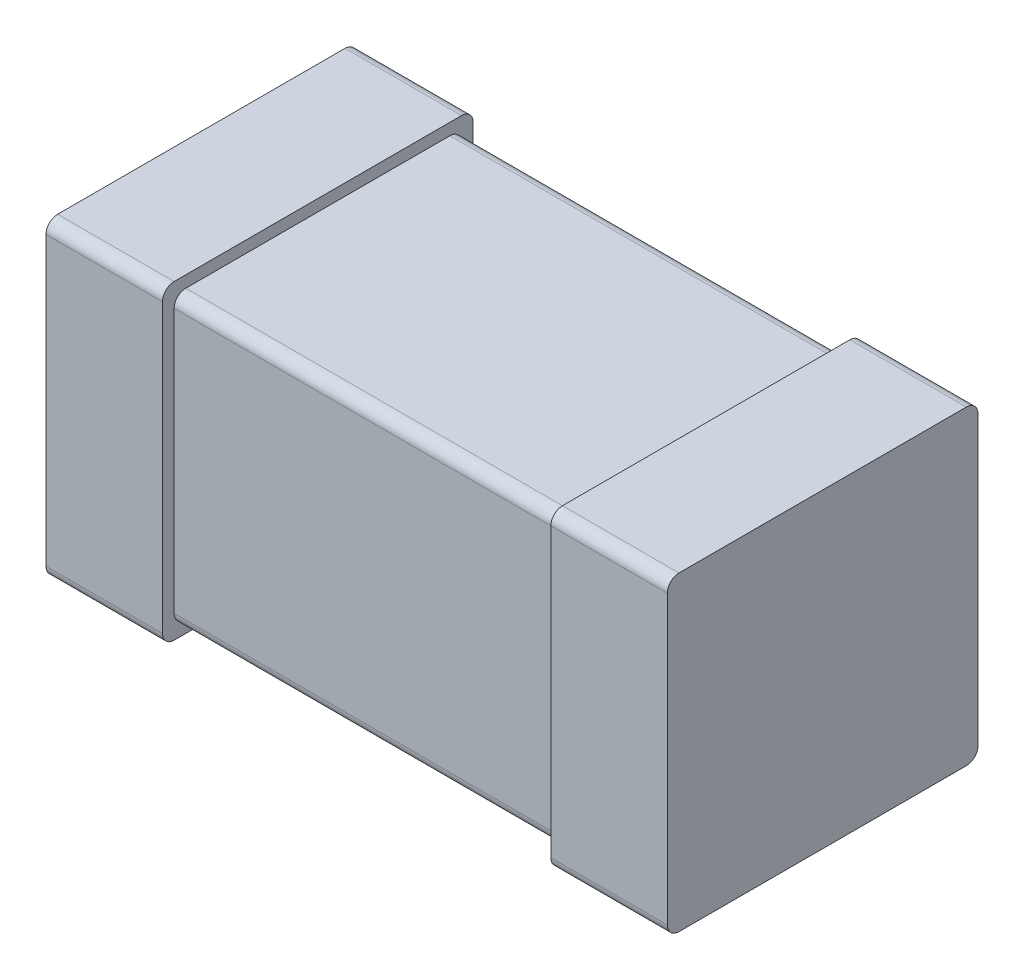
ISO-10303-21;
HEADER;
FILE_DESCRIPTION(('STEP AP214'),'2;1');
FILE_NAME('part.step','',(''),(''),'','','');
FILE_SCHEMA(('AUTOMOTIVE_DESIGN { 1 0 10303 214 1 1 1 1 }'));
ENDSEC;
DATA;
#1=APPLICATION_CONTEXT('core data for automotive mechanical design processes');
#2=APPLICATION_PROTOCOL_DEFINITION('international standard','automotive_design',2000,#1);
#3=PRODUCT_CONTEXT('',#1,'mechanical');
#4=PRODUCT('Part','Part','',(#3));
#5=PRODUCT_RELATED_PRODUCT_CATEGORY('part','',(#4));
#6=PRODUCT_DEFINITION_FORMATION('','',#4);
#7=PRODUCT_DEFINITION_CONTEXT('part definition',#1,'design');
#8=PRODUCT_DEFINITION('design','',#6,#7);
#9=PRODUCT_DEFINITION_SHAPE('','',#8);
#10=(LENGTH_UNIT() NAMED_UNIT(*) SI_UNIT(.MILLI.,.METRE.));
#11=(NAMED_UNIT(*) PLANE_ANGLE_UNIT() SI_UNIT($,.RADIAN.));
#12=(NAMED_UNIT(*) SI_UNIT($,.STERADIAN.) SOLID_ANGLE_UNIT());
#13=UNCERTAINTY_MEASURE_WITH_UNIT(LENGTH_MEASURE(1.E-05),#10,'distance_accuracy_value','');
#14=(GEOMETRIC_REPRESENTATION_CONTEXT(3) GLOBAL_UNCERTAINTY_ASSIGNED_CONTEXT((#13)) GLOBAL_UNIT_ASSIGNED_CONTEXT((#10,
#11,#12)) REPRESENTATION_CONTEXT('',''));
#15=CARTESIAN_POINT('',(0.,0.,0.));
#16=DIRECTION('',(0.,0.,1.));
#17=DIRECTION('',(1.,0.,0.));
#18=AXIS2_PLACEMENT_3D('',#15,#16,#17);
#19=CARTESIAN_POINT('',(0.8,-0.4,0.));
#20=DIRECTION('',(1.,0.,0.));
#21=DIRECTION('',(0.,1.,0.));
#22=AXIS2_PLACEMENT_3D('',#19,#20,#21);
#23=PLANE('',#22);
#24=DIRECTION('',(0.,0.,1.));
#25=VECTOR('',#24,1.);
#26=CARTESIAN_POINT('',(0.8,-0.4,0.));
#27=LINE('',#26,#25);
#28=CARTESIAN_POINT('',(0.8,-0.4,0.03));
#29=VERTEX_POINT('',#28);
#30=CARTESIAN_POINT('',(0.8,-0.4,0.77));
#31=VERTEX_POINT('',#30);
#32=EDGE_CURVE('E241',#29,#31,#27,.T.);
#33=ORIENTED_EDGE('',*,*,#32,.F.);
#34=CARTESIAN_POINT('',(0.8,-0.37,0.03));
#35=DIRECTION('',(1.,0.,0.));
#36=DIRECTION('',(0.,0.,1.));
#37=AXIS2_PLACEMENT_3D('',#34,#35,#36);
#38=CIRCLE('',#37,0.03);
#39=CARTESIAN_POINT('',(0.8,-0.37,0.));
#40=VERTEX_POINT('',#39);
#41=EDGE_CURVE('E304',#29,#40,#38,.T.);
#42=ORIENTED_EDGE('',*,*,#41,.T.);
#43=DIRECTION('',(0.,1.,0.));
#44=VECTOR('',#43,1.);
#45=CARTESIAN_POINT('',(0.8,-0.4,0.));
#46=LINE('',#45,#44);
#47=CARTESIAN_POINT('',(0.8,0.37,0.));
#48=VERTEX_POINT('',#47);
#49=EDGE_CURVE('E316',#40,#48,#46,.T.);
#50=ORIENTED_EDGE('',*,*,#49,.T.);
#51=CARTESIAN_POINT('',(0.8,0.37,0.03));
#52=DIRECTION('',(-1.,0.,0.));
#53=DIRECTION('',(0.,0.,1.));
#54=AXIS2_PLACEMENT_3D('',#51,#52,#53);
#55=CIRCLE('',#54,0.03);
#56=CARTESIAN_POINT('',(0.8,0.4,0.03));
#57=VERTEX_POINT('',#56);
#58=EDGE_CURVE('E227',#57,#48,#55,.T.);
#59=ORIENTED_EDGE('',*,*,#58,.F.);
#60=DIRECTION('',(0.,0.,1.));
#61=VECTOR('',#60,1.);
#62=CARTESIAN_POINT('',(0.8,0.4,0.));
#63=LINE('',#62,#61);
#64=CARTESIAN_POINT('',(0.8,0.4,0.77));
#65=VERTEX_POINT('',#64);
#66=EDGE_CURVE('E11',#57,#65,#63,.T.);
#67=ORIENTED_EDGE('',*,*,#66,.T.);
#68=CARTESIAN_POINT('',(0.8,0.37,0.77));
#69=DIRECTION('',(1.,0.,0.));
#70=DIRECTION('',(0.,0.,1.));
#71=AXIS2_PLACEMENT_3D('',#68,#69,#70);
#72=CIRCLE('',#71,0.03);
#73=CARTESIAN_POINT('',(0.8,0.37,0.8));
#74=VERTEX_POINT('',#73);
#75=EDGE_CURVE('E225',#65,#74,#72,.T.);
#76=ORIENTED_EDGE('',*,*,#75,.T.);
#77=DIRECTION('',(0.,1.,0.));
#78=VECTOR('',#77,1.);
#79=CARTESIAN_POINT('',(0.8,-0.4,0.8));
#80=LINE('',#79,#78);
#81=CARTESIAN_POINT('',(0.8,-0.37,0.8));
#82=VERTEX_POINT('',#81);
#83=EDGE_CURVE('E319',#82,#74,#80,.T.);
#84=ORIENTED_EDGE('',*,*,#83,.F.);
#85=CARTESIAN_POINT('',(0.8,-0.37,0.77));
#86=DIRECTION('',(-1.,0.,0.));
#87=DIRECTION('',(0.,0.,1.));
#88=AXIS2_PLACEMENT_3D('',#85,#86,#87);
#89=CIRCLE('',#88,0.03);
#90=EDGE_CURVE('E375',#31,#82,#89,.T.);
#91=ORIENTED_EDGE('',*,*,#90,.F.);
#92=EDGE_LOOP('',(#33,#42,#50,#59,#67,#76,#84,#91));
#93=FACE_BOUND('',#92,.T.);
#94=ADVANCED_FACE('F17',(#93),#23,.T.);
#95=CARTESIAN_POINT('',(0.5,0.4,0.));
#96=DIRECTION('',(0.,1.,0.));
#97=DIRECTION('',(1.,0.,0.));
#98=AXIS2_PLACEMENT_3D('',#95,#96,#97);
#99=PLANE('',#98);
#100=ORIENTED_EDGE('',*,*,#66,.F.);
#101=DIRECTION('',(1.,0.,0.));
#102=VECTOR('',#101,1.);
#103=CARTESIAN_POINT('',(0.5,0.4,0.03));
#104=LINE('',#103,#102);
#105=CARTESIAN_POINT('',(0.5,0.4,0.03));
#106=VERTEX_POINT('',#105);
#107=EDGE_CURVE('E247',#106,#57,#104,.T.);
#108=ORIENTED_EDGE('',*,*,#107,.F.);
#109=DIRECTION('',(0.,0.,1.));
#110=VECTOR('',#109,1.);
#111=CARTESIAN_POINT('',(0.5,0.4,0.));
#112=LINE('',#111,#110);
#113=CARTESIAN_POINT('',(0.5,0.4,0.77));
#114=VERTEX_POINT('',#113);
#115=EDGE_CURVE('E408',#106,#114,#112,.T.);
#116=ORIENTED_EDGE('',*,*,#115,.T.);
#117=DIRECTION('',(1.,0.,0.));
#118=VECTOR('',#117,1.);
#119=CARTESIAN_POINT('',(0.5,0.4,0.77));
#120=LINE('',#119,#118);
#121=EDGE_CURVE('E28',#114,#65,#120,.T.);
#122=ORIENTED_EDGE('',*,*,#121,.T.);
#123=EDGE_LOOP('',(#100,#108,#116,#122));
#124=FACE_BOUND('',#123,.T.);
#125=ADVANCED_FACE('F572',(#124),#99,.T.);
#126=CARTESIAN_POINT('',(0.5,0.37,0.77));
#127=DIRECTION('',(1.,0.,0.));
#128=DIRECTION('',(0.,1.,0.));
#129=AXIS2_PLACEMENT_3D('',#126,#127,#128);
#130=CYLINDRICAL_SURFACE('',#129,0.03);
#131=CARTESIAN_POINT('',(0.5,0.37,0.77));
#132=DIRECTION('',(1.,0.,0.));
#133=DIRECTION('',(0.,0.,1.));
#134=AXIS2_PLACEMENT_3D('',#131,#132,#133);
#135=CIRCLE('',#134,0.03);
#136=CARTESIAN_POINT('',(0.5,0.37,0.8));
#137=VERTEX_POINT('',#136);
#138=EDGE_CURVE('E335',#114,#137,#135,.T.);
#139=ORIENTED_EDGE('',*,*,#138,.T.);
#140=DIRECTION('',(1.,0.,0.));
#141=VECTOR('',#140,1.);
#142=CARTESIAN_POINT('',(0.5,0.37,0.8));
#143=LINE('',#142,#141);
#144=EDGE_CURVE('E251',#137,#74,#143,.T.);
#145=ORIENTED_EDGE('',*,*,#144,.T.);
#146=ORIENTED_EDGE('',*,*,#75,.F.);
#147=ORIENTED_EDGE('',*,*,#121,.F.);
#148=EDGE_LOOP('',(#139,#145,#146,#147));
#149=FACE_BOUND('',#148,.T.);
#150=ADVANCED_FACE('F498',(#149),#130,.T.);
#151=CARTESIAN_POINT('',(0.5,0.37,0.03));
#152=DIRECTION('',(1.,0.,0.));
#153=DIRECTION('',(0.,1.,0.));
#154=AXIS2_PLACEMENT_3D('',#151,#152,#153);
#155=CYLINDRICAL_SURFACE('',#154,0.03);
#156=ORIENTED_EDGE('',*,*,#107,.T.);
#157=ORIENTED_EDGE('',*,*,#58,.T.);
#158=DIRECTION('',(1.,0.,0.));
#159=VECTOR('',#158,1.);
#160=CARTESIAN_POINT('',(0.5,0.37,0.));
#161=LINE('',#160,#159);
#162=CARTESIAN_POINT('',(0.5,0.37,0.));
#163=VERTEX_POINT('',#162);
#164=EDGE_CURVE('E320',#163,#48,#161,.T.);
#165=ORIENTED_EDGE('',*,*,#164,.F.);
#166=CARTESIAN_POINT('',(0.5,0.37,0.03));
#167=DIRECTION('',(-1.,0.,0.));
#168=DIRECTION('',(0.,0.,1.));
#169=AXIS2_PLACEMENT_3D('',#166,#167,#168);
#170=CIRCLE('',#169,0.03);
#171=EDGE_CURVE('E21',#106,#163,#170,.T.);
#172=ORIENTED_EDGE('',*,*,#171,.F.);
#173=EDGE_LOOP('',(#156,#157,#165,#172));
#174=FACE_BOUND('',#173,.T.);
#175=ADVANCED_FACE('F619',(#174),#155,.T.);
#176=CARTESIAN_POINT('',(0.5,-0.4,0.8));
#177=DIRECTION('',(0.,0.,1.));
#178=DIRECTION('',(1.,0.,0.));
#179=AXIS2_PLACEMENT_3D('',#176,#177,#178);
#180=PLANE('',#179);
#181=DIRECTION('',(0.,1.,0.));
#182=VECTOR('',#181,1.);
#183=CARTESIAN_POINT('',(0.5,-0.4,0.8));
#184=LINE('',#183,#182);
#185=CARTESIAN_POINT('',(0.5,-0.37,0.8));
#186=VERTEX_POINT('',#185);
#187=EDGE_CURVE('E331',#186,#137,#184,.T.);
#188=ORIENTED_EDGE('',*,*,#187,.F.);
#189=DIRECTION('',(1.,0.,0.));
#190=VECTOR('',#189,1.);
#191=CARTESIAN_POINT('',(0.5,-0.37,0.8));
#192=LINE('',#191,#190);
#193=EDGE_CURVE('E392',#186,#82,#192,.T.);
#194=ORIENTED_EDGE('',*,*,#193,.T.);
#195=ORIENTED_EDGE('',*,*,#83,.T.);
#196=ORIENTED_EDGE('',*,*,#144,.F.);
#197=EDGE_LOOP('',(#188,#194,#195,#196));
#198=FACE_BOUND('',#197,.T.);
#199=ADVANCED_FACE('F493',(#198),#180,.T.);
#200=CARTESIAN_POINT('',(0.5,-0.4,0.));
#201=DIRECTION('',(0.,0.,1.));
#202=DIRECTION('',(1.,0.,0.));
#203=AXIS2_PLACEMENT_3D('',#200,#201,#202);
#204=PLANE('',#203);
#205=ORIENTED_EDGE('',*,*,#164,.T.);
#206=ORIENTED_EDGE('',*,*,#49,.F.);
#207=DIRECTION('',(1.,0.,0.));
#208=VECTOR('',#207,1.);
#209=CARTESIAN_POINT('',(0.5,-0.37,0.));
#210=LINE('',#209,#208);
#211=CARTESIAN_POINT('',(0.5,-0.37,0.));
#212=VERTEX_POINT('',#211);
#213=EDGE_CURVE('E245',#212,#40,#210,.T.);
#214=ORIENTED_EDGE('',*,*,#213,.F.);
#215=DIRECTION('',(0.,1.,0.));
#216=VECTOR('',#215,1.);
#217=CARTESIAN_POINT('',(0.5,-0.4,0.));
#218=LINE('',#217,#216);
#219=EDGE_CURVE('E240',#212,#163,#218,.T.);
#220=ORIENTED_EDGE('',*,*,#219,.T.);
#221=EDGE_LOOP('',(#205,#206,#214,#220));
#222=FACE_BOUND('',#221,.T.);
#223=ADVANCED_FACE('F608',(#222),#204,.F.);
#224=CARTESIAN_POINT('',(0.5,-0.37,0.77));
#225=DIRECTION('',(1.,0.,0.));
#226=DIRECTION('',(0.,-1.,0.));
#227=AXIS2_PLACEMENT_3D('',#224,#225,#226);
#228=CYLINDRICAL_SURFACE('',#227,0.03);
#229=DIRECTION('',(1.,0.,0.));
#230=VECTOR('',#229,1.);
#231=CARTESIAN_POINT('',(0.5,-0.4,0.77));
#232=LINE('',#231,#230);
#233=CARTESIAN_POINT('',(0.5,-0.4,0.77));
#234=VERTEX_POINT('',#233);
#235=EDGE_CURVE('E297',#234,#31,#232,.T.);
#236=ORIENTED_EDGE('',*,*,#235,.T.);
#237=ORIENTED_EDGE('',*,*,#90,.T.);
#238=ORIENTED_EDGE('',*,*,#193,.F.);
#239=CARTESIAN_POINT('',(0.5,-0.37,0.77));
#240=DIRECTION('',(-1.,0.,0.));
#241=DIRECTION('',(0.,0.,1.));
#242=AXIS2_PLACEMENT_3D('',#239,#240,#241);
#243=CIRCLE('',#242,0.03);
#244=EDGE_CURVE('E336',#234,#186,#243,.T.);
#245=ORIENTED_EDGE('',*,*,#244,.F.);
#246=EDGE_LOOP('',(#236,#237,#238,#245));
#247=FACE_BOUND('',#246,.T.);
#248=ADVANCED_FACE('F431',(#247),#228,.T.);
#249=CARTESIAN_POINT('',(0.5,-0.37,0.03));
#250=DIRECTION('',(1.,0.,0.));
#251=DIRECTION('',(0.,-1.,0.));
#252=AXIS2_PLACEMENT_3D('',#249,#250,#251);
#253=CYLINDRICAL_SURFACE('',#252,0.03);
#254=CARTESIAN_POINT('',(0.5,-0.37,0.03));
#255=DIRECTION('',(1.,0.,0.));
#256=DIRECTION('',(0.,0.,1.));
#257=AXIS2_PLACEMENT_3D('',#254,#255,#256);
#258=CIRCLE('',#257,0.03);
#259=CARTESIAN_POINT('',(0.5,-0.4,0.03));
#260=VERTEX_POINT('',#259);
#261=EDGE_CURVE('E235',#260,#212,#258,.T.);
#262=ORIENTED_EDGE('',*,*,#261,.T.);
#263=ORIENTED_EDGE('',*,*,#213,.T.);
#264=ORIENTED_EDGE('',*,*,#41,.F.);
#265=DIRECTION('',(1.,0.,0.));
#266=VECTOR('',#265,1.);
#267=CARTESIAN_POINT('',(0.5,-0.4,0.03));
#268=LINE('',#267,#266);
#269=EDGE_CURVE('E246',#260,#29,#268,.T.);
#270=ORIENTED_EDGE('',*,*,#269,.F.);
#271=EDGE_LOOP('',(#262,#263,#264,#270));
#272=FACE_BOUND('',#271,.T.);
#273=ADVANCED_FACE('F442',(#272),#253,.T.);
#274=CARTESIAN_POINT('',(0.5,-0.4,0.));
#275=DIRECTION('',(0.,1.,0.));
#276=DIRECTION('',(1.,0.,0.));
#277=AXIS2_PLACEMENT_3D('',#274,#275,#276);
#278=PLANE('',#277);
#279=ORIENTED_EDGE('',*,*,#235,.F.);
#280=DIRECTION('',(0.,0.,1.));
#281=VECTOR('',#280,1.);
#282=CARTESIAN_POINT('',(0.5,-0.4,0.));
#283=LINE('',#282,#281);
#284=EDGE_CURVE('E239',#260,#234,#283,.T.);
#285=ORIENTED_EDGE('',*,*,#284,.F.);
#286=ORIENTED_EDGE('',*,*,#269,.T.);
#287=ORIENTED_EDGE('',*,*,#32,.T.);
#288=EDGE_LOOP('',(#279,#285,#286,#287));
#289=FACE_BOUND('',#288,.T.);
#290=ADVANCED_FACE('F434',(#289),#278,.F.);
#291=CARTESIAN_POINT('',(0.5,-0.4,0.));
#292=DIRECTION('',(1.,0.,0.));
#293=DIRECTION('',(0.,1.,0.));
#294=AXIS2_PLACEMENT_3D('',#291,#292,#293);
#295=PLANE('',#294);
#296=DIRECTION('',(0.,1.,0.));
#297=VECTOR('',#296,1.);
#298=CARTESIAN_POINT('',(0.5,-0.37,0.03));
#299=LINE('',#298,#297);
#300=CARTESIAN_POINT('',(0.5,-0.34,0.03));
#301=VERTEX_POINT('',#300);
#302=CARTESIAN_POINT('',(0.5,0.34,0.03));
#303=VERTEX_POINT('',#302);
#304=EDGE_CURVE('E234',#301,#303,#299,.T.);
#305=ORIENTED_EDGE('',*,*,#304,.T.);
#306=CARTESIAN_POINT('',(0.5,0.34,0.06));
#307=DIRECTION('',(-1.,0.,0.));
#308=DIRECTION('',(0.,0.,1.));
#309=AXIS2_PLACEMENT_3D('',#306,#307,#308);
#310=CIRCLE('',#309,0.03);
#311=CARTESIAN_POINT('',(0.5,0.37,0.06));
#312=VERTEX_POINT('',#311);
#313=EDGE_CURVE('E233',#312,#303,#310,.T.);
#314=ORIENTED_EDGE('',*,*,#313,.F.);
#315=DIRECTION('',(0.,0.,1.));
#316=VECTOR('',#315,1.);
#317=CARTESIAN_POINT('',(0.5,0.37,0.03));
#318=LINE('',#317,#316);
#319=CARTESIAN_POINT('',(0.5,0.37,0.74));
#320=VERTEX_POINT('',#319);
#321=EDGE_CURVE('E252',#312,#320,#318,.T.);
#322=ORIENTED_EDGE('',*,*,#321,.T.);
#323=CARTESIAN_POINT('',(0.5,0.34,0.74));
#324=DIRECTION('',(1.,0.,0.));
#325=DIRECTION('',(0.,0.,1.));
#326=AXIS2_PLACEMENT_3D('',#323,#324,#325);
#327=CIRCLE('',#326,0.03);
#328=CARTESIAN_POINT('',(0.5,0.34,0.77));
#329=VERTEX_POINT('',#328);
#330=EDGE_CURVE('E221',#320,#329,#327,.T.);
#331=ORIENTED_EDGE('',*,*,#330,.T.);
#332=DIRECTION('',(0.,1.,0.));
#333=VECTOR('',#332,1.);
#334=CARTESIAN_POINT('',(0.5,-0.37,0.77));
#335=LINE('',#334,#333);
#336=CARTESIAN_POINT('',(0.5,-0.34,0.77));
#337=VERTEX_POINT('',#336);
#338=EDGE_CURVE('E345',#337,#329,#335,.T.);
#339=ORIENTED_EDGE('',*,*,#338,.F.);
#340=CARTESIAN_POINT('',(0.5,-0.34,0.74));
#341=DIRECTION('',(-1.,0.,0.));
#342=DIRECTION('',(0.,0.,1.));
#343=AXIS2_PLACEMENT_3D('',#340,#341,#342);
#344=CIRCLE('',#343,0.03);
#345=CARTESIAN_POINT('',(0.5,-0.37,0.74));
#346=VERTEX_POINT('',#345);
#347=EDGE_CURVE('E346',#346,#337,#344,.T.);
#348=ORIENTED_EDGE('',*,*,#347,.F.);
#349=DIRECTION('',(0.,0.,1.));
#350=VECTOR('',#349,1.);
#351=CARTESIAN_POINT('',(0.5,-0.37,0.03));
#352=LINE('',#351,#350);
#353=CARTESIAN_POINT('',(0.5,-0.37,0.06));
#354=VERTEX_POINT('',#353);
#355=EDGE_CURVE('E349',#354,#346,#352,.T.);
#356=ORIENTED_EDGE('',*,*,#355,.F.);
#357=CARTESIAN_POINT('',(0.5,-0.34,0.06));
#358=DIRECTION('',(1.,0.,0.));
#359=DIRECTION('',(0.,0.,1.));
#360=AXIS2_PLACEMENT_3D('',#357,#358,#359);
#361=CIRCLE('',#360,0.03);
#362=EDGE_CURVE('E260',#354,#301,#361,.T.);
#363=ORIENTED_EDGE('',*,*,#362,.T.);
#364=EDGE_LOOP('',(#305,#314,#322,#331,#339,#348,#356,#363));
#365=FACE_BOUND('',#364,.T.);
#366=ORIENTED_EDGE('',*,*,#244,.T.);
#367=ORIENTED_EDGE('',*,*,#187,.T.);
#368=ORIENTED_EDGE('',*,*,#138,.F.);
#369=ORIENTED_EDGE('',*,*,#115,.F.);
#370=ORIENTED_EDGE('',*,*,#171,.T.);
#371=ORIENTED_EDGE('',*,*,#219,.F.);
#372=ORIENTED_EDGE('',*,*,#261,.F.);
#373=ORIENTED_EDGE('',*,*,#284,.T.);
#374=EDGE_LOOP('',(#366,#367,#368,#369,#370,#371,#372,#373));
#375=FACE_BOUND('',#374,.T.);
#376=ADVANCED_FACE('F438',(#365,#375),#295,.F.);
#377=CARTESIAN_POINT('',(-0.5,-0.37,0.03));
#378=DIRECTION('',(0.,1.,0.));
#379=DIRECTION('',(1.,0.,0.));
#380=AXIS2_PLACEMENT_3D('',#377,#378,#379);
#381=PLANE('',#380);
#382=DIRECTION('',(1.,0.,0.));
#383=VECTOR('',#382,1.);
#384=CARTESIAN_POINT('',(-0.5,-0.37,0.74));
#385=LINE('',#384,#383);
#386=CARTESIAN_POINT('',(-0.5,-0.37,0.74));
#387=VERTEX_POINT('',#386);
#388=EDGE_CURVE('E350',#387,#346,#385,.T.);
#389=ORIENTED_EDGE('',*,*,#388,.F.);
#390=DIRECTION('',(0.,0.,1.));
#391=VECTOR('',#390,1.);
#392=CARTESIAN_POINT('',(-0.5,-0.37,0.03));
#393=LINE('',#392,#391);
#394=CARTESIAN_POINT('',(-0.5,-0.37,0.06));
#395=VERTEX_POINT('',#394);
#396=EDGE_CURVE('E412',#395,#387,#393,.T.);
#397=ORIENTED_EDGE('',*,*,#396,.F.);
#398=DIRECTION('',(1.,0.,0.));
#399=VECTOR('',#398,1.);
#400=CARTESIAN_POINT('',(-0.5,-0.37,0.06));
#401=LINE('',#400,#399);
#402=EDGE_CURVE('E264',#395,#354,#401,.T.);
#403=ORIENTED_EDGE('',*,*,#402,.T.);
#404=ORIENTED_EDGE('',*,*,#355,.T.);
#405=EDGE_LOOP('',(#389,#397,#403,#404));
#406=FACE_BOUND('',#405,.T.);
#407=ADVANCED_FACE('F581',(#406),#381,.F.);
#408=CARTESIAN_POINT('',(-0.5,-0.34,0.74));
#409=DIRECTION('',(1.,0.,0.));
#410=DIRECTION('',(0.,-1.,0.));
#411=AXIS2_PLACEMENT_3D('',#408,#409,#410);
#412=CYLINDRICAL_SURFACE('',#411,0.03);
#413=ORIENTED_EDGE('',*,*,#388,.T.);
#414=ORIENTED_EDGE('',*,*,#347,.T.);
#415=DIRECTION('',(1.,0.,0.));
#416=VECTOR('',#415,1.);
#417=CARTESIAN_POINT('',(-0.5,-0.34,0.77));
#418=LINE('',#417,#416);
#419=CARTESIAN_POINT('',(-0.5,-0.34,0.77));
#420=VERTEX_POINT('',#419);
#421=EDGE_CURVE('E224',#420,#337,#418,.T.);
#422=ORIENTED_EDGE('',*,*,#421,.F.);
#423=CARTESIAN_POINT('',(-0.5,-0.34,0.74));
#424=DIRECTION('',(-1.,0.,0.));
#425=DIRECTION('',(0.,0.,1.));
#426=AXIS2_PLACEMENT_3D('',#423,#424,#425);
#427=CIRCLE('',#426,0.03);
#428=EDGE_CURVE('E386',#387,#420,#427,.T.);
#429=ORIENTED_EDGE('',*,*,#428,.F.);
#430=EDGE_LOOP('',(#413,#414,#422,#429));
#431=FACE_BOUND('',#430,.T.);
#432=ADVANCED_FACE('F615',(#431),#412,.T.);
#433=CARTESIAN_POINT('',(-0.5,-0.37,0.77));
#434=DIRECTION('',(0.,0.,1.));
#435=DIRECTION('',(1.,0.,0.));
#436=AXIS2_PLACEMENT_3D('',#433,#434,#435);
#437=PLANE('',#436);
#438=DIRECTION('',(0.,1.,0.));
#439=VECTOR('',#438,1.);
#440=CARTESIAN_POINT('',(-0.5,-0.37,0.77));
#441=LINE('',#440,#439);
#442=CARTESIAN_POINT('',(-0.5,0.34,0.77));
#443=VERTEX_POINT('',#442);
#444=EDGE_CURVE('E382',#420,#443,#441,.T.);
#445=ORIENTED_EDGE('',*,*,#444,.F.);
#446=ORIENTED_EDGE('',*,*,#421,.T.);
#447=ORIENTED_EDGE('',*,*,#338,.T.);
#448=DIRECTION('',(1.,0.,0.));
#449=VECTOR('',#448,1.);
#450=CARTESIAN_POINT('',(-0.5,0.34,0.77));
#451=LINE('',#450,#449);
#452=EDGE_CURVE('E219',#443,#329,#451,.T.);
#453=ORIENTED_EDGE('',*,*,#452,.F.);
#454=EDGE_LOOP('',(#445,#446,#447,#453));
#455=FACE_BOUND('',#454,.T.);
#456=ADVANCED_FACE('F612',(#455),#437,.T.);
#457=CARTESIAN_POINT('',(-0.5,0.34,0.74));
#458=DIRECTION('',(1.,0.,0.));
#459=DIRECTION('',(0.,1.,0.));
#460=AXIS2_PLACEMENT_3D('',#457,#458,#459);
#461=CYLINDRICAL_SURFACE('',#460,0.03);
#462=CARTESIAN_POINT('',(-0.5,0.34,0.74));
#463=DIRECTION('',(1.,0.,0.));
#464=DIRECTION('',(0.,0.,1.));
#465=AXIS2_PLACEMENT_3D('',#462,#463,#464);
#466=CIRCLE('',#465,0.03);
#467=CARTESIAN_POINT('',(-0.5,0.37,0.74));
#468=VERTEX_POINT('',#467);
#469=EDGE_CURVE('E312',#468,#443,#466,.T.);
#470=ORIENTED_EDGE('',*,*,#469,.T.);
#471=ORIENTED_EDGE('',*,*,#452,.T.);
#472=ORIENTED_EDGE('',*,*,#330,.F.);
#473=DIRECTION('',(1.,0.,0.));
#474=VECTOR('',#473,1.);
#475=CARTESIAN_POINT('',(-0.5,0.37,0.74));
#476=LINE('',#475,#474);
#477=EDGE_CURVE('E256',#468,#320,#476,.T.);
#478=ORIENTED_EDGE('',*,*,#477,.F.);
#479=EDGE_LOOP('',(#470,#471,#472,#478));
#480=FACE_BOUND('',#479,.T.);
#481=ADVANCED_FACE('F614',(#480),#461,.T.);
#482=CARTESIAN_POINT('',(-0.5,0.37,0.03));
#483=DIRECTION('',(0.,1.,0.));
#484=DIRECTION('',(1.,0.,0.));
#485=AXIS2_PLACEMENT_3D('',#482,#483,#484);
#486=PLANE('',#485);
#487=ORIENTED_EDGE('',*,*,#321,.F.);
#488=DIRECTION('',(1.,0.,0.));
#489=VECTOR('',#488,1.);
#490=CARTESIAN_POINT('',(-0.5,0.37,0.06));
#491=LINE('',#490,#489);
#492=CARTESIAN_POINT('',(-0.5,0.37,0.06));
#493=VERTEX_POINT('',#492);
#494=EDGE_CURVE('E229',#493,#312,#491,.T.);
#495=ORIENTED_EDGE('',*,*,#494,.F.);
#496=DIRECTION('',(0.,0.,1.));
#497=VECTOR('',#496,1.);
#498=CARTESIAN_POINT('',(-0.5,0.37,0.03));
#499=LINE('',#498,#497);
#500=EDGE_CURVE('E307',#493,#468,#499,.T.);
#501=ORIENTED_EDGE('',*,*,#500,.T.);
#502=ORIENTED_EDGE('',*,*,#477,.T.);
#503=EDGE_LOOP('',(#487,#495,#501,#502));
#504=FACE_BOUND('',#503,.T.);
#505=ADVANCED_FACE('F624',(#504),#486,.T.);
#506=CARTESIAN_POINT('',(-0.5,0.34,0.06));
#507=DIRECTION('',(1.,0.,0.));
#508=DIRECTION('',(0.,1.,0.));
#509=AXIS2_PLACEMENT_3D('',#506,#507,#508);
#510=CYLINDRICAL_SURFACE('',#509,0.03);
#511=ORIENTED_EDGE('',*,*,#494,.T.);
#512=ORIENTED_EDGE('',*,*,#313,.T.);
#513=DIRECTION('',(1.,0.,0.));
#514=VECTOR('',#513,1.);
#515=CARTESIAN_POINT('',(-0.5,0.34,0.03));
#516=LINE('',#515,#514);
#517=CARTESIAN_POINT('',(-0.5,0.34,0.03));
#518=VERTEX_POINT('',#517);
#519=EDGE_CURVE('E293',#518,#303,#516,.T.);
#520=ORIENTED_EDGE('',*,*,#519,.F.);
#521=CARTESIAN_POINT('',(-0.5,0.34,0.06));
#522=DIRECTION('',(-1.,0.,0.));
#523=DIRECTION('',(0.,0.,1.));
#524=AXIS2_PLACEMENT_3D('',#521,#522,#523);
#525=CIRCLE('',#524,0.03);
#526=EDGE_CURVE('E311',#493,#518,#525,.T.);
#527=ORIENTED_EDGE('',*,*,#526,.F.);
#528=EDGE_LOOP('',(#511,#512,#520,#527));
#529=FACE_BOUND('',#528,.T.);
#530=ADVANCED_FACE('F591',(#529),#510,.T.);
#531=CARTESIAN_POINT('',(-0.5,-0.37,0.03));
#532=DIRECTION('',(0.,0.,1.));
#533=DIRECTION('',(1.,0.,0.));
#534=AXIS2_PLACEMENT_3D('',#531,#532,#533);
#535=PLANE('',#534);
#536=ORIENTED_EDGE('',*,*,#519,.T.);
#537=ORIENTED_EDGE('',*,*,#304,.F.);
#538=DIRECTION('',(1.,0.,0.));
#539=VECTOR('',#538,1.);
#540=CARTESIAN_POINT('',(-0.5,-0.34,0.03));
#541=LINE('',#540,#539);
#542=CARTESIAN_POINT('',(-0.5,-0.34,0.03));
#543=VERTEX_POINT('',#542);
#544=EDGE_CURVE('E265',#543,#301,#541,.T.);
#545=ORIENTED_EDGE('',*,*,#544,.F.);
#546=DIRECTION('',(0.,1.,0.));
#547=VECTOR('',#546,1.);
#548=CARTESIAN_POINT('',(-0.5,-0.37,0.03));
#549=LINE('',#548,#547);
#550=EDGE_CURVE('E289',#543,#518,#549,.T.);
#551=ORIENTED_EDGE('',*,*,#550,.T.);
#552=EDGE_LOOP('',(#536,#537,#545,#551));
#553=FACE_BOUND('',#552,.T.);
#554=ADVANCED_FACE('F565',(#553),#535,.F.);
#555=CARTESIAN_POINT('',(-0.5,-0.34,0.06));
#556=DIRECTION('',(1.,0.,0.));
#557=DIRECTION('',(0.,-1.,0.));
#558=AXIS2_PLACEMENT_3D('',#555,#556,#557);
#559=CYLINDRICAL_SURFACE('',#558,0.03);
#560=CARTESIAN_POINT('',(-0.5,-0.34,0.06));
#561=DIRECTION('',(1.,0.,0.));
#562=DIRECTION('',(0.,0.,1.));
#563=AXIS2_PLACEMENT_3D('',#560,#561,#562);
#564=CIRCLE('',#563,0.03);
#565=EDGE_CURVE('E371',#395,#543,#564,.T.);
#566=ORIENTED_EDGE('',*,*,#565,.T.);
#567=ORIENTED_EDGE('',*,*,#544,.T.);
#568=ORIENTED_EDGE('',*,*,#362,.F.);
#569=ORIENTED_EDGE('',*,*,#402,.F.);
#570=EDGE_LOOP('',(#566,#567,#568,#569));
#571=FACE_BOUND('',#570,.T.);
#572=ADVANCED_FACE('F553',(#571),#559,.T.);
#573=CARTESIAN_POINT('',(-0.5,-0.4,0.));
#574=DIRECTION('',(1.,0.,0.));
#575=DIRECTION('',(0.,1.,0.));
#576=AXIS2_PLACEMENT_3D('',#573,#574,#575);
#577=PLANE('',#576);
#578=ORIENTED_EDGE('',*,*,#565,.F.);
#579=ORIENTED_EDGE('',*,*,#396,.T.);
#580=ORIENTED_EDGE('',*,*,#428,.T.);
#581=ORIENTED_EDGE('',*,*,#444,.T.);
#582=ORIENTED_EDGE('',*,*,#469,.F.);
#583=ORIENTED_EDGE('',*,*,#500,.F.);
#584=ORIENTED_EDGE('',*,*,#526,.T.);
#585=ORIENTED_EDGE('',*,*,#550,.F.);
#586=EDGE_LOOP('',(#578,#579,#580,#581,#582,#583,#584,#585));
#587=FACE_BOUND('',#586,.T.);
#588=DIRECTION('',(0.,0.,1.));
#589=VECTOR('',#588,1.);
#590=CARTESIAN_POINT('',(-0.5,-0.4,0.));
#591=LINE('',#590,#589);
#592=CARTESIAN_POINT('',(-0.5,-0.4,0.03));
#593=VERTEX_POINT('',#592);
#594=CARTESIAN_POINT('',(-0.5,-0.4,0.77));
#595=VERTEX_POINT('',#594);
#596=EDGE_CURVE('E526',#593,#595,#591,.T.);
#597=ORIENTED_EDGE('',*,*,#596,.F.);
#598=CARTESIAN_POINT('',(-0.5,-0.37,0.03));
#599=DIRECTION('',(1.,0.,0.));
#600=DIRECTION('',(0.,0.,1.));
#601=AXIS2_PLACEMENT_3D('',#598,#599,#600);
#602=CIRCLE('',#601,0.03);
#603=CARTESIAN_POINT('',(-0.5,-0.37,0.));
#604=VERTEX_POINT('',#603);
#605=EDGE_CURVE('E381',#593,#604,#602,.T.);
#606=ORIENTED_EDGE('',*,*,#605,.T.);
#607=DIRECTION('',(0.,1.,0.));
#608=VECTOR('',#607,1.);
#609=CARTESIAN_POINT('',(-0.5,-0.4,0.));
#610=LINE('',#609,#608);
#611=CARTESIAN_POINT('',(-0.5,0.37,0.));
#612=VERTEX_POINT('',#611);
#613=EDGE_CURVE('E269',#604,#612,#610,.T.);
#614=ORIENTED_EDGE('',*,*,#613,.T.);
#615=CARTESIAN_POINT('',(-0.5,0.37,0.03));
#616=DIRECTION('',(-1.,0.,0.));
#617=DIRECTION('',(0.,0.,1.));
#618=AXIS2_PLACEMENT_3D('',#615,#616,#617);
#619=CIRCLE('',#618,0.03);
#620=CARTESIAN_POINT('',(-0.5,0.4,0.03));
#621=VERTEX_POINT('',#620);
#622=EDGE_CURVE('E270',#621,#612,#619,.T.);
#623=ORIENTED_EDGE('',*,*,#622,.F.);
#624=DIRECTION('',(0.,0.,1.));
#625=VECTOR('',#624,1.);
#626=CARTESIAN_POINT('',(-0.5,0.4,0.));
#627=LINE('',#626,#625);
#628=CARTESIAN_POINT('',(-0.5,0.4,0.77));
#629=VERTEX_POINT('',#628);
#630=EDGE_CURVE('E171',#621,#629,#627,.T.);
#631=ORIENTED_EDGE('',*,*,#630,.T.);
#632=CARTESIAN_POINT('',(-0.5,0.37,0.77));
#633=DIRECTION('',(1.,0.,0.));
#634=DIRECTION('',(0.,0.,1.));
#635=AXIS2_PLACEMENT_3D('',#632,#633,#634);
#636=CIRCLE('',#635,0.03);
#637=CARTESIAN_POINT('',(-0.5,0.37,0.8));
#638=VERTEX_POINT('',#637);
#639=EDGE_CURVE('E161',#629,#638,#636,.T.);
#640=ORIENTED_EDGE('',*,*,#639,.T.);
#641=DIRECTION('',(0.,1.,0.));
#642=VECTOR('',#641,1.);
#643=CARTESIAN_POINT('',(-0.5,-0.4,0.8));
#644=LINE('',#643,#642);
#645=CARTESIAN_POINT('',(-0.5,-0.37,0.8));
#646=VERTEX_POINT('',#645);
#647=EDGE_CURVE('E266',#646,#638,#644,.T.);
#648=ORIENTED_EDGE('',*,*,#647,.F.);
#649=CARTESIAN_POINT('',(-0.5,-0.37,0.77));
#650=DIRECTION('',(-1.,0.,0.));
#651=DIRECTION('',(0.,0.,1.));
#652=AXIS2_PLACEMENT_3D('',#649,#650,#651);
#653=CIRCLE('',#652,0.03);
#654=EDGE_CURVE('E191',#595,#646,#653,.T.);
#655=ORIENTED_EDGE('',*,*,#654,.F.);
#656=EDGE_LOOP('',(#597,#606,#614,#623,#631,#640,#648,#655));
#657=FACE_BOUND('',#656,.T.);
#658=ADVANCED_FACE('F547',(#587,#657),#577,.T.);
#659=CARTESIAN_POINT('',(-0.8,0.4,0.));
#660=DIRECTION('',(0.,1.,0.));
#661=DIRECTION('',(1.,0.,0.));
#662=AXIS2_PLACEMENT_3D('',#659,#660,#661);
#663=PLANE('',#662);
#664=ORIENTED_EDGE('',*,*,#630,.F.);
#665=DIRECTION('',(1.,0.,0.));
#666=VECTOR('',#665,1.);
#667=CARTESIAN_POINT('',(-0.8,0.4,0.03));
#668=LINE('',#667,#666);
#669=CARTESIAN_POINT('',(-0.8,0.4,0.03));
#670=VERTEX_POINT('',#669);
#671=EDGE_CURVE('E273',#670,#621,#668,.T.);
#672=ORIENTED_EDGE('',*,*,#671,.F.);
#673=DIRECTION('',(0.,0.,1.));
#674=VECTOR('',#673,1.);
#675=CARTESIAN_POINT('',(-0.8,0.4,0.));
#676=LINE('',#675,#674);
#677=CARTESIAN_POINT('',(-0.8,0.4,0.77));
#678=VERTEX_POINT('',#677);
#679=EDGE_CURVE('E259',#670,#678,#676,.T.);
#680=ORIENTED_EDGE('',*,*,#679,.T.);
#681=DIRECTION('',(1.,0.,0.));
#682=VECTOR('',#681,1.);
#683=CARTESIAN_POINT('',(-0.8,0.4,0.77));
#684=LINE('',#683,#682);
#685=EDGE_CURVE('E279',#678,#629,#684,.T.);
#686=ORIENTED_EDGE('',*,*,#685,.T.);
#687=EDGE_LOOP('',(#664,#672,#680,#686));
#688=FACE_BOUND('',#687,.T.);
#689=ADVANCED_FACE('F552',(#688),#663,.T.);
#690=CARTESIAN_POINT('',(-0.8,0.37,0.77));
#691=DIRECTION('',(1.,0.,0.));
#692=DIRECTION('',(0.,1.,0.));
#693=AXIS2_PLACEMENT_3D('',#690,#691,#692);
#694=CYLINDRICAL_SURFACE('',#693,0.03);
#695=CARTESIAN_POINT('',(-0.8,0.37,0.77));
#696=DIRECTION('',(1.,0.,0.));
#697=DIRECTION('',(0.,0.,1.));
#698=AXIS2_PLACEMENT_3D('',#695,#696,#697);
#699=CIRCLE('',#698,0.03);
#700=CARTESIAN_POINT('',(-0.8,0.37,0.8));
#701=VERTEX_POINT('',#700);
#702=EDGE_CURVE('E205',#678,#701,#699,.T.);
#703=ORIENTED_EDGE('',*,*,#702,.T.);
#704=DIRECTION('',(1.,0.,0.));
#705=VECTOR('',#704,1.);
#706=CARTESIAN_POINT('',(-0.8,0.37,0.8));
#707=LINE('',#706,#705);
#708=EDGE_CURVE('E200',#701,#638,#707,.T.);
#709=ORIENTED_EDGE('',*,*,#708,.T.);
#710=ORIENTED_EDGE('',*,*,#639,.F.);
#711=ORIENTED_EDGE('',*,*,#685,.F.);
#712=EDGE_LOOP('',(#703,#709,#710,#711));
#713=FACE_BOUND('',#712,.T.);
#714=ADVANCED_FACE('F562',(#713),#694,.T.);
#715=CARTESIAN_POINT('',(-0.8,0.37,0.03));
#716=DIRECTION('',(1.,0.,0.));
#717=DIRECTION('',(0.,1.,0.));
#718=AXIS2_PLACEMENT_3D('',#715,#716,#717);
#719=CYLINDRICAL_SURFACE('',#718,0.03);
#720=ORIENTED_EDGE('',*,*,#671,.T.);
#721=ORIENTED_EDGE('',*,*,#622,.T.);
#722=DIRECTION('',(1.,0.,0.));
#723=VECTOR('',#722,1.);
#724=CARTESIAN_POINT('',(-0.8,0.37,0.));
#725=LINE('',#724,#723);
#726=CARTESIAN_POINT('',(-0.8,0.37,0.));
#727=VERTEX_POINT('',#726);
#728=EDGE_CURVE('E195',#727,#612,#725,.T.);
#729=ORIENTED_EDGE('',*,*,#728,.F.);
#730=CARTESIAN_POINT('',(-0.8,0.37,0.03));
#731=DIRECTION('',(-1.,0.,0.));
#732=DIRECTION('',(0.,0.,1.));
#733=AXIS2_PLACEMENT_3D('',#730,#731,#732);
#734=CIRCLE('',#733,0.03);
#735=EDGE_CURVE('E285',#670,#727,#734,.T.);
#736=ORIENTED_EDGE('',*,*,#735,.F.);
#737=EDGE_LOOP('',(#720,#721,#729,#736));
#738=FACE_BOUND('',#737,.T.);
#739=ADVANCED_FACE('F595',(#738),#719,.T.);
#740=CARTESIAN_POINT('',(-0.8,-0.4,0.8));
#741=DIRECTION('',(0.,0.,1.));
#742=DIRECTION('',(1.,0.,0.));
#743=AXIS2_PLACEMENT_3D('',#740,#741,#742);
#744=PLANE('',#743);
#745=DIRECTION('',(0.,1.,0.));
#746=VECTOR('',#745,1.);
#747=CARTESIAN_POINT('',(-0.8,-0.4,0.8));
#748=LINE('',#747,#746);
#749=CARTESIAN_POINT('',(-0.8,-0.37,0.8));
#750=VERTEX_POINT('',#749);
#751=EDGE_CURVE('E198',#750,#701,#748,.T.);
#752=ORIENTED_EDGE('',*,*,#751,.F.);
#753=DIRECTION('',(1.,0.,0.));
#754=VECTOR('',#753,1.);
#755=CARTESIAN_POINT('',(-0.8,-0.37,0.8));
#756=LINE('',#755,#754);
#757=EDGE_CURVE('E185',#750,#646,#756,.T.);
#758=ORIENTED_EDGE('',*,*,#757,.T.);
#759=ORIENTED_EDGE('',*,*,#647,.T.);
#760=ORIENTED_EDGE('',*,*,#708,.F.);
#761=EDGE_LOOP('',(#752,#758,#759,#760));
#762=FACE_BOUND('',#761,.T.);
#763=ADVANCED_FACE('F199',(#762),#744,.T.);
#764=CARTESIAN_POINT('',(-0.8,-0.4,0.));
#765=DIRECTION('',(0.,0.,1.));
#766=DIRECTION('',(1.,0.,0.));
#767=AXIS2_PLACEMENT_3D('',#764,#765,#766);
#768=PLANE('',#767);
#769=ORIENTED_EDGE('',*,*,#728,.T.);
#770=ORIENTED_EDGE('',*,*,#613,.F.);
#771=DIRECTION('',(1.,0.,0.));
#772=VECTOR('',#771,1.);
#773=CARTESIAN_POINT('',(-0.8,-0.37,0.));
#774=LINE('',#773,#772);
#775=CARTESIAN_POINT('',(-0.8,-0.37,0.));
#776=VERTEX_POINT('',#775);
#777=EDGE_CURVE('E422',#776,#604,#774,.T.);
#778=ORIENTED_EDGE('',*,*,#777,.F.);
#779=DIRECTION('',(0.,1.,0.));
#780=VECTOR('',#779,1.);
#781=CARTESIAN_POINT('',(-0.8,-0.4,0.));
#782=LINE('',#781,#780);
#783=EDGE_CURVE('E280',#776,#727,#782,.T.);
#784=ORIENTED_EDGE('',*,*,#783,.T.);
#785=EDGE_LOOP('',(#769,#770,#778,#784));
#786=FACE_BOUND('',#785,.T.);
#787=ADVANCED_FACE('F546',(#786),#768,.F.);
#788=CARTESIAN_POINT('',(-0.8,-0.37,0.77));
#789=DIRECTION('',(1.,0.,0.));
#790=DIRECTION('',(0.,-1.,0.));
#791=AXIS2_PLACEMENT_3D('',#788,#789,#790);
#792=CYLINDRICAL_SURFACE('',#791,0.03);
#793=DIRECTION('',(1.,0.,0.));
#794=VECTOR('',#793,1.);
#795=CARTESIAN_POINT('',(-0.8,-0.4,0.77));
#796=LINE('',#795,#794);
#797=CARTESIAN_POINT('',(-0.8,-0.4,0.77));
#798=VERTEX_POINT('',#797);
#799=EDGE_CURVE('E300',#798,#595,#796,.T.);
#800=ORIENTED_EDGE('',*,*,#799,.T.);
#801=ORIENTED_EDGE('',*,*,#654,.T.);
#802=ORIENTED_EDGE('',*,*,#757,.F.);
#803=CARTESIAN_POINT('',(-0.8,-0.37,0.77));
#804=DIRECTION('',(-1.,0.,0.));
#805=DIRECTION('',(0.,0.,1.));
#806=AXIS2_PLACEMENT_3D('',#803,#804,#805);
#807=CIRCLE('',#806,0.03);
#808=EDGE_CURVE('E189',#798,#750,#807,.T.);
#809=ORIENTED_EDGE('',*,*,#808,.F.);
#810=EDGE_LOOP('',(#800,#801,#802,#809));
#811=FACE_BOUND('',#810,.T.);
#812=ADVANCED_FACE('F19',(#811),#792,.T.);
#813=CARTESIAN_POINT('',(-0.8,-0.37,0.03));
#814=DIRECTION('',(1.,0.,0.));
#815=DIRECTION('',(0.,-1.,0.));
#816=AXIS2_PLACEMENT_3D('',#813,#814,#815);
#817=CYLINDRICAL_SURFACE('',#816,0.03);
#818=CARTESIAN_POINT('',(-0.8,-0.37,0.03));
#819=DIRECTION('',(1.,0.,0.));
#820=DIRECTION('',(0.,0.,1.));
#821=AXIS2_PLACEMENT_3D('',#818,#819,#820);
#822=CIRCLE('',#821,0.03);
#823=CARTESIAN_POINT('',(-0.8,-0.4,0.03));
#824=VERTEX_POINT('',#823);
#825=EDGE_CURVE('E284',#824,#776,#822,.T.);
#826=ORIENTED_EDGE('',*,*,#825,.T.);
#827=ORIENTED_EDGE('',*,*,#777,.T.);
#828=ORIENTED_EDGE('',*,*,#605,.F.);
#829=DIRECTION('',(1.,0.,0.));
#830=VECTOR('',#829,1.);
#831=CARTESIAN_POINT('',(-0.8,-0.4,0.03));
#832=LINE('',#831,#830);
#833=EDGE_CURVE('E391',#824,#593,#832,.T.);
#834=ORIENTED_EDGE('',*,*,#833,.F.);
#835=EDGE_LOOP('',(#826,#827,#828,#834));
#836=FACE_BOUND('',#835,.T.);
#837=ADVANCED_FACE('F541',(#836),#817,.T.);
#838=CARTESIAN_POINT('',(-0.8,-0.4,0.));
#839=DIRECTION('',(0.,1.,0.));
#840=DIRECTION('',(1.,0.,0.));
#841=AXIS2_PLACEMENT_3D('',#838,#839,#840);
#842=PLANE('',#841);
#843=ORIENTED_EDGE('',*,*,#799,.F.);
#844=DIRECTION('',(0.,0.,1.));
#845=VECTOR('',#844,1.);
#846=CARTESIAN_POINT('',(-0.8,-0.4,0.));
#847=LINE('',#846,#845);
#848=EDGE_CURVE('E211',#824,#798,#847,.T.);
#849=ORIENTED_EDGE('',*,*,#848,.F.);
#850=ORIENTED_EDGE('',*,*,#833,.T.);
#851=ORIENTED_EDGE('',*,*,#596,.T.);
#852=EDGE_LOOP('',(#843,#849,#850,#851));
#853=FACE_BOUND('',#852,.T.);
#854=ADVANCED_FACE('F585',(#853),#842,.F.);
#855=CARTESIAN_POINT('',(-0.8,-0.4,0.));
#856=DIRECTION('',(1.,0.,0.));
#857=DIRECTION('',(0.,1.,0.));
#858=AXIS2_PLACEMENT_3D('',#855,#856,#857);
#859=PLANE('',#858);
#860=ORIENTED_EDGE('',*,*,#808,.T.);
#861=ORIENTED_EDGE('',*,*,#751,.T.);
#862=ORIENTED_EDGE('',*,*,#702,.F.);
#863=ORIENTED_EDGE('',*,*,#679,.F.);
#864=ORIENTED_EDGE('',*,*,#735,.T.);
#865=ORIENTED_EDGE('',*,*,#783,.F.);
#866=ORIENTED_EDGE('',*,*,#825,.F.);
#867=ORIENTED_EDGE('',*,*,#848,.T.);
#868=EDGE_LOOP('',(#860,#861,#862,#863,#864,#865,#866,#867));
#869=FACE_BOUND('',#868,.T.);
#870=ADVANCED_FACE('F208',(#869),#859,.F.);
#871=CLOSED_SHELL('',(#94,#125,#150,#175,#199,#223,#248,#273,#290,#376,#407,#432,#456,#481,#505,
#530,#554,#572,#658,#689,#714,#739,#763,#787,#812,#837,#854,#870));
#872=MANIFOLD_SOLID_BREP('B1',#871);
#873=ADVANCED_BREP_SHAPE_REPRESENTATION('',(#18,#872),#14);
#874=SHAPE_DEFINITION_REPRESENTATION(#9,#873);
ENDSEC;
END-ISO-10303-21;
